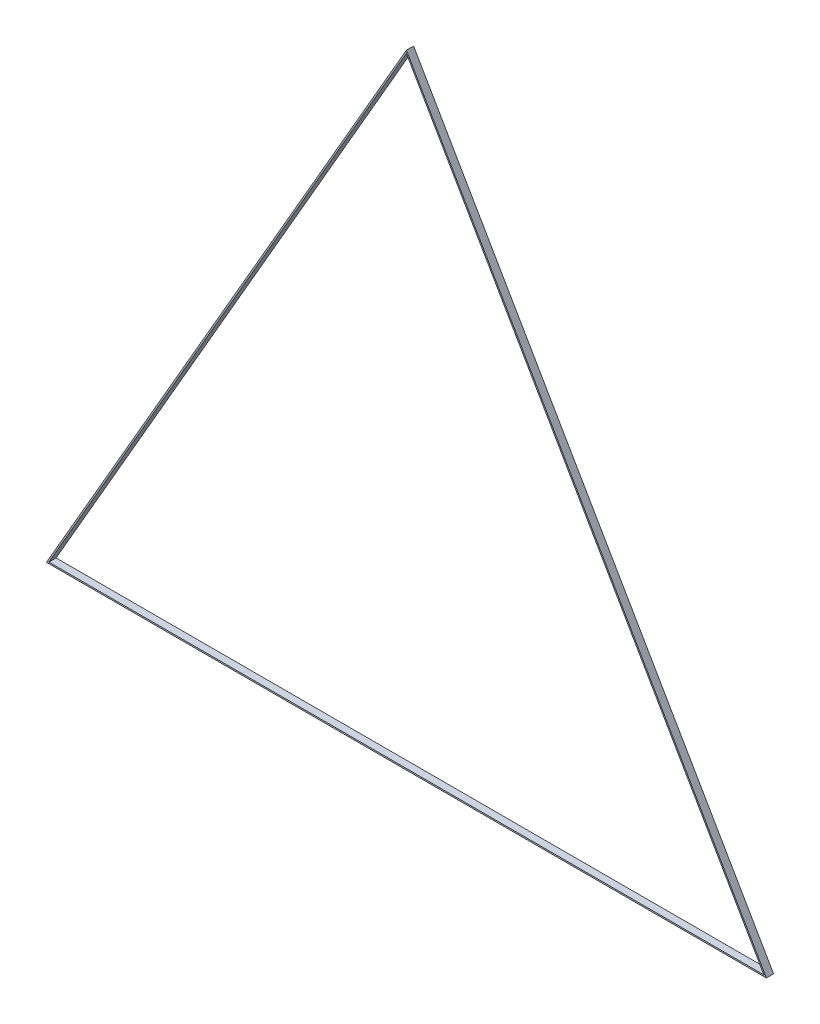
ISO-10303-21;
HEADER;
FILE_DESCRIPTION(('STEP AP214'),'2;1');
FILE_NAME('part.step','',(''),(''),'','','');
FILE_SCHEMA(('AUTOMOTIVE_DESIGN { 1 0 10303 214 1 1 1 1 }'));
ENDSEC;
DATA;
#1=APPLICATION_CONTEXT('core data for automotive mechanical design processes');
#2=APPLICATION_PROTOCOL_DEFINITION('international standard','automotive_design',2000,#1);
#3=PRODUCT_CONTEXT('',#1,'mechanical');
#4=PRODUCT('Part','Part','',(#3));
#5=PRODUCT_RELATED_PRODUCT_CATEGORY('part','',(#4));
#6=PRODUCT_DEFINITION_FORMATION('','',#4);
#7=PRODUCT_DEFINITION_CONTEXT('part definition',#1,'design');
#8=PRODUCT_DEFINITION('design','',#6,#7);
#9=PRODUCT_DEFINITION_SHAPE('','',#8);
#10=(LENGTH_UNIT() NAMED_UNIT(*) SI_UNIT(.MILLI.,.METRE.));
#11=(NAMED_UNIT(*) PLANE_ANGLE_UNIT() SI_UNIT($,.RADIAN.));
#12=(NAMED_UNIT(*) SI_UNIT($,.STERADIAN.) SOLID_ANGLE_UNIT());
#13=UNCERTAINTY_MEASURE_WITH_UNIT(LENGTH_MEASURE(1.E-05),#10,'distance_accuracy_value','');
#14=(GEOMETRIC_REPRESENTATION_CONTEXT(3) GLOBAL_UNCERTAINTY_ASSIGNED_CONTEXT((#13)) GLOBAL_UNIT_ASSIGNED_CONTEXT((#10,
#11,#12)) REPRESENTATION_CONTEXT('',''));
#15=CARTESIAN_POINT('',(0.,0.,0.));
#16=DIRECTION('',(0.,0.,1.));
#17=DIRECTION('',(1.,0.,0.));
#18=AXIS2_PLACEMENT_3D('',#15,#16,#17);
#19=CARTESIAN_POINT('',(-496.535898385,2.,0.));
#20=DIRECTION('',(0.,-1.,0.));
#21=DIRECTION('',(1.,0.,0.));
#22=AXIS2_PLACEMENT_3D('',#19,#20,#21);
#23=PLANE('',#22);
#24=DIRECTION('',(0.,0.,-1.));
#25=VECTOR('',#24,1.);
#26=CARTESIAN_POINT('',(496.535898385,2.,5.));
#27=LINE('',#26,#25);
#28=CARTESIAN_POINT('',(496.53589840419,1.99999996676209,10.));
#29=VERTEX_POINT('',#28);
#30=CARTESIAN_POINT('',(496.5358981925,1.99999995014311,0.));
#31=VERTEX_POINT('',#30);
#32=EDGE_CURVE('E112',#29,#31,#27,.T.);
#33=ORIENTED_EDGE('',*,*,#32,.T.);
#34=DIRECTION('',(1.,0.,0.));
#35=VECTOR('',#34,1.);
#36=CARTESIAN_POINT('',(0.,1.99999993352417,0.));
#37=LINE('',#36,#35);
#38=CARTESIAN_POINT('',(-496.5358981925,1.99999995014313,0.));
#39=VERTEX_POINT('',#38);
#40=EDGE_CURVE('E91',#39,#31,#37,.T.);
#41=ORIENTED_EDGE('',*,*,#40,.F.);
#42=DIRECTION('',(0.,0.,1.));
#43=VECTOR('',#42,1.);
#44=CARTESIAN_POINT('',(-496.535898385,2.,5.));
#45=LINE('',#44,#43);
#46=CARTESIAN_POINT('',(-496.53589840419,1.99999996676206,10.));
#47=VERTEX_POINT('',#46);
#48=EDGE_CURVE('E71',#39,#47,#45,.T.);
#49=ORIENTED_EDGE('',*,*,#48,.T.);
#50=DIRECTION('',(1.,0.,0.));
#51=VECTOR('',#50,1.);
#52=CARTESIAN_POINT('',(0.,1.99999993352417,10.));
#53=LINE('',#52,#51);
#54=EDGE_CURVE('E100',#47,#29,#53,.T.);
#55=ORIENTED_EDGE('',*,*,#54,.T.);
#56=EDGE_LOOP('',(#33,#41,#49,#55));
#57=FACE_BOUND('',#56,.T.);
#58=ADVANCED_FACE('F16',(#57),#23,.F.);
#59=CARTESIAN_POINT('',(496.535898385,2.,0.));
#60=DIRECTION('',(0.866025403784268,0.500000000000295,0.));
#61=DIRECTION('',(-0.500000000000295,0.866025403784268,0.));
#62=AXIS2_PLACEMENT_3D('',#59,#60,#61);
#63=PLANE('',#62);
#64=DIRECTION('',(0.,0.,-1.));
#65=VECTOR('',#64,1.);
#66=CARTESIAN_POINT('',(0.,862.025403784,5.));
#67=LINE('',#66,#65);
#68=CARTESIAN_POINT('',(0.,862.025403784,10.));
#69=VERTEX_POINT('',#68);
#70=CARTESIAN_POINT('',(-1.43924221842406E-08,862.025403858785,0.));
#71=VERTEX_POINT('',#70);
#72=EDGE_CURVE('E113',#69,#71,#67,.T.);
#73=ORIENTED_EDGE('',*,*,#72,.T.);
#74=DIRECTION('',(-0.499999999622574,0.866025404002346,0.));
#75=VECTOR('',#74,1.);
#76=CARTESIAN_POINT('',(496.535898,1.99999993352417,0.));
#77=LINE('',#76,#75);
#78=EDGE_CURVE('E83',#31,#71,#77,.T.);
#79=ORIENTED_EDGE('',*,*,#78,.F.);
#80=ORIENTED_EDGE('',*,*,#32,.F.);
#81=DIRECTION('',(-0.500000000000295,0.866025403784268,0.));
#82=VECTOR('',#81,1.);
#83=CARTESIAN_POINT('',(496.535898385,2.,10.));
#84=LINE('',#83,#82);
#85=EDGE_CURVE('E90',#29,#69,#84,.T.);
#86=ORIENTED_EDGE('',*,*,#85,.T.);
#87=EDGE_LOOP('',(#73,#79,#80,#86));
#88=FACE_BOUND('',#87,.T.);
#89=ADVANCED_FACE('F122',(#88),#63,.F.);
#90=CARTESIAN_POINT('',(0.,862.025403784,0.));
#91=DIRECTION('',(-0.866025403784268,0.500000000000295,0.));
#92=DIRECTION('',(-0.500000000000295,-0.866025403784268,0.));
#93=AXIS2_PLACEMENT_3D('',#90,#91,#92);
#94=PLANE('',#93);
#95=ORIENTED_EDGE('',*,*,#48,.F.);
#96=DIRECTION('',(-0.499999999622574,-0.866025404002346,0.));
#97=VECTOR('',#96,1.);
#98=CARTESIAN_POINT('',(-7.81158471241383E-08,862.025403781651,0.));
#99=LINE('',#98,#97);
#100=EDGE_CURVE('E80',#71,#39,#99,.T.);
#101=ORIENTED_EDGE('',*,*,#100,.F.);
#102=ORIENTED_EDGE('',*,*,#72,.F.);
#103=DIRECTION('',(-0.500000000000295,-0.866025403784268,0.));
#104=VECTOR('',#103,1.);
#105=CARTESIAN_POINT('',(0.,862.025403784,10.));
#106=LINE('',#105,#104);
#107=EDGE_CURVE('E70',#69,#47,#106,.T.);
#108=ORIENTED_EDGE('',*,*,#107,.T.);
#109=EDGE_LOOP('',(#95,#101,#102,#108));
#110=FACE_BOUND('',#109,.T.);
#111=ADVANCED_FACE('F126',(#110),#94,.F.);
#112=CARTESIAN_POINT('',(-500.,0.,0.));
#113=DIRECTION('',(0.866025403784329,-0.50000000000019,0.));
#114=DIRECTION('',(0.50000000000019,0.866025403784329,0.));
#115=AXIS2_PLACEMENT_3D('',#112,#113,#114);
#116=PLANE('',#115);
#117=DIRECTION('',(0.,0.,1.));
#118=VECTOR('',#117,1.);
#119=CARTESIAN_POINT('',(-500.,0.,5.));
#120=LINE('',#119,#118);
#121=CARTESIAN_POINT('',(-500.,0.,0.));
#122=VERTEX_POINT('',#121);
#123=CARTESIAN_POINT('',(-500.,0.,10.));
#124=VERTEX_POINT('',#123);
#125=EDGE_CURVE('E74',#122,#124,#120,.T.);
#126=ORIENTED_EDGE('',*,*,#125,.T.);
#127=DIRECTION('',(0.50000000000019,0.866025403784329,0.));
#128=VECTOR('',#127,1.);
#129=CARTESIAN_POINT('',(-500.,0.,10.));
#130=LINE('',#129,#128);
#131=CARTESIAN_POINT('',(0.,866.025403784,10.));
#132=VERTEX_POINT('',#131);
#133=EDGE_CURVE('E20',#124,#132,#130,.T.);
#134=ORIENTED_EDGE('',*,*,#133,.T.);
#135=DIRECTION('',(0.,0.,-1.));
#136=VECTOR('',#135,1.);
#137=CARTESIAN_POINT('',(0.,866.025403784,5.));
#138=LINE('',#137,#136);
#139=CARTESIAN_POINT('',(0.,866.025403784,0.));
#140=VERTEX_POINT('',#139);
#141=EDGE_CURVE('E87',#132,#140,#138,.T.);
#142=ORIENTED_EDGE('',*,*,#141,.T.);
#143=DIRECTION('',(0.50000000000019,0.866025403784329,0.));
#144=VECTOR('',#143,1.);
#145=CARTESIAN_POINT('',(-500.,0.,0.));
#146=LINE('',#145,#144);
#147=EDGE_CURVE('E79',#122,#140,#146,.T.);
#148=ORIENTED_EDGE('',*,*,#147,.F.);
#149=EDGE_LOOP('',(#126,#134,#142,#148));
#150=FACE_BOUND('',#149,.T.);
#151=ADVANCED_FACE('F78',(#150),#116,.F.);
#152=CARTESIAN_POINT('',(500.,0.,10.));
#153=DIRECTION('',(0.,0.,-1.));
#154=DIRECTION('',(-1.,0.,0.));
#155=AXIS2_PLACEMENT_3D('',#152,#153,#154);
#156=PLANE('',#155);
#157=ORIENTED_EDGE('',*,*,#54,.F.);
#158=ORIENTED_EDGE('',*,*,#107,.F.);
#159=ORIENTED_EDGE('',*,*,#85,.F.);
#160=EDGE_LOOP('',(#157,#158,#159));
#161=FACE_BOUND('',#160,.T.);
#162=DIRECTION('',(-0.50000000000019,0.866025403784329,0.));
#163=VECTOR('',#162,1.);
#164=CARTESIAN_POINT('',(250.,433.012701892,10.));
#165=LINE('',#164,#163);
#166=CARTESIAN_POINT('',(500.,0.,10.));
#167=VERTEX_POINT('',#166);
#168=EDGE_CURVE('E65',#167,#132,#165,.T.);
#169=ORIENTED_EDGE('',*,*,#168,.T.);
#170=ORIENTED_EDGE('',*,*,#133,.F.);
#171=DIRECTION('',(1.,0.,0.));
#172=VECTOR('',#171,1.);
#173=CARTESIAN_POINT('',(0.,0.,10.));
#174=LINE('',#173,#172);
#175=EDGE_CURVE('E64',#124,#167,#174,.T.);
#176=ORIENTED_EDGE('',*,*,#175,.T.);
#177=EDGE_LOOP('',(#169,#170,#176));
#178=FACE_BOUND('',#177,.T.);
#179=ADVANCED_FACE('F63',(#161,#178),#156,.F.);
#180=CARTESIAN_POINT('',(0.,866.025403784,0.));
#181=DIRECTION('',(-0.866025403784329,-0.50000000000019,0.));
#182=DIRECTION('',(0.50000000000019,-0.866025403784329,0.));
#183=AXIS2_PLACEMENT_3D('',#180,#181,#182);
#184=PLANE('',#183);
#185=ORIENTED_EDGE('',*,*,#141,.F.);
#186=ORIENTED_EDGE('',*,*,#168,.F.);
#187=DIRECTION('',(0.,0.,-1.));
#188=VECTOR('',#187,1.);
#189=CARTESIAN_POINT('',(500.,0.,5.));
#190=LINE('',#189,#188);
#191=CARTESIAN_POINT('',(500.,0.,0.));
#192=VERTEX_POINT('',#191);
#193=EDGE_CURVE('E26',#167,#192,#190,.T.);
#194=ORIENTED_EDGE('',*,*,#193,.T.);
#195=DIRECTION('',(0.50000000000019,-0.866025403784329,0.));
#196=VECTOR('',#195,1.);
#197=CARTESIAN_POINT('',(3.49384965403488E-08,866.025403723484,0.));
#198=LINE('',#197,#196);
#199=EDGE_CURVE('E34',#140,#192,#198,.T.);
#200=ORIENTED_EDGE('',*,*,#199,.F.);
#201=EDGE_LOOP('',(#185,#186,#194,#200));
#202=FACE_BOUND('',#201,.T.);
#203=ADVANCED_FACE('F140',(#202),#184,.F.);
#204=CARTESIAN_POINT('',(500.,0.,0.));
#205=DIRECTION('',(0.,0.,-1.));
#206=DIRECTION('',(-1.,0.,0.));
#207=AXIS2_PLACEMENT_3D('',#204,#205,#206);
#208=PLANE('',#207);
#209=ORIENTED_EDGE('',*,*,#78,.T.);
#210=ORIENTED_EDGE('',*,*,#100,.T.);
#211=ORIENTED_EDGE('',*,*,#40,.T.);
#212=EDGE_LOOP('',(#209,#210,#211));
#213=FACE_BOUND('',#212,.T.);
#214=ORIENTED_EDGE('',*,*,#147,.T.);
#215=ORIENTED_EDGE('',*,*,#199,.T.);
#216=DIRECTION('',(-1.,0.,0.));
#217=VECTOR('',#216,1.);
#218=CARTESIAN_POINT('',(0.,0.,0.));
#219=LINE('',#218,#217);
#220=EDGE_CURVE('E10',#192,#122,#219,.T.);
#221=ORIENTED_EDGE('',*,*,#220,.T.);
#222=EDGE_LOOP('',(#214,#215,#221));
#223=FACE_BOUND('',#222,.T.);
#224=ADVANCED_FACE('F124',(#213,#223),#208,.T.);
#225=CARTESIAN_POINT('',(500.,0.,0.));
#226=DIRECTION('',(0.,1.,0.));
#227=DIRECTION('',(-1.,0.,0.));
#228=AXIS2_PLACEMENT_3D('',#225,#226,#227);
#229=PLANE('',#228);
#230=ORIENTED_EDGE('',*,*,#193,.F.);
#231=ORIENTED_EDGE('',*,*,#175,.F.);
#232=ORIENTED_EDGE('',*,*,#125,.F.);
#233=ORIENTED_EDGE('',*,*,#220,.F.);
#234=EDGE_LOOP('',(#230,#231,#232,#233));
#235=FACE_BOUND('',#234,.T.);
#236=ADVANCED_FACE('F18',(#235),#229,.F.);
#237=CLOSED_SHELL('',(#58,#89,#111,#151,#179,#203,#224,#236));
#238=MANIFOLD_SOLID_BREP('B1',#237);
#239=ADVANCED_BREP_SHAPE_REPRESENTATION('',(#18,#238),#14);
#240=SHAPE_DEFINITION_REPRESENTATION(#9,#239);
ENDSEC;
END-ISO-10303-21;
